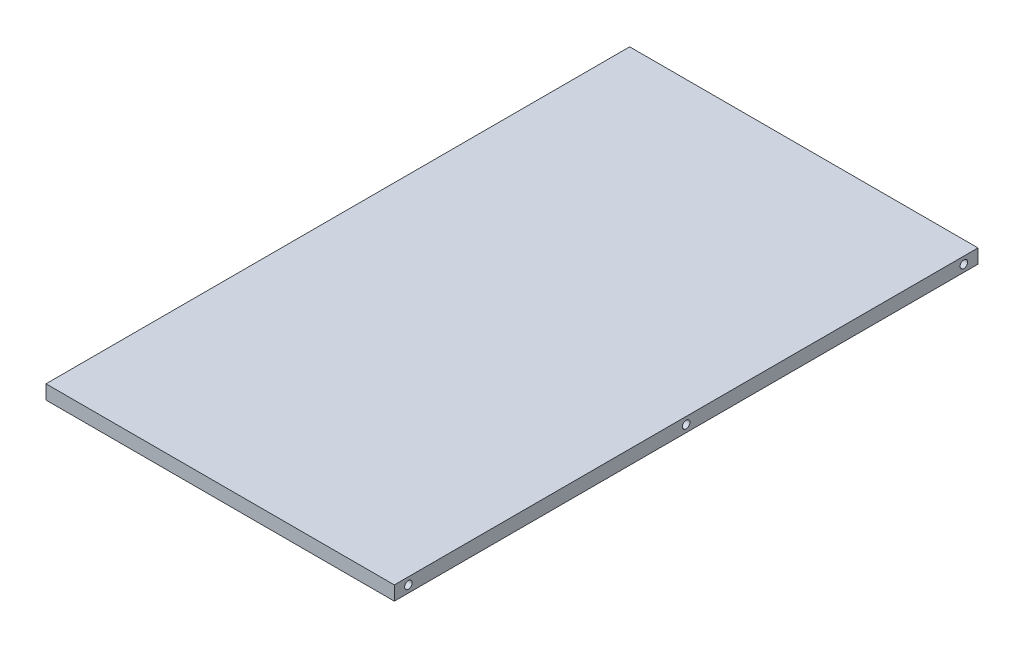
ISO-10303-21;
HEADER;
FILE_DESCRIPTION(('STEP AP214'),'2;1');
FILE_NAME('part.step','',(''),(''),'','','');
FILE_SCHEMA(('AUTOMOTIVE_DESIGN { 1 0 10303 214 1 1 1 1 }'));
ENDSEC;
DATA;
#1=APPLICATION_CONTEXT('core data for automotive mechanical design processes');
#2=APPLICATION_PROTOCOL_DEFINITION('international standard','automotive_design',2000,#1);
#3=PRODUCT_CONTEXT('',#1,'mechanical');
#4=PRODUCT('Part','Part','',(#3));
#5=PRODUCT_RELATED_PRODUCT_CATEGORY('part','',(#4));
#6=PRODUCT_DEFINITION_FORMATION('','',#4);
#7=PRODUCT_DEFINITION_CONTEXT('part definition',#1,'design');
#8=PRODUCT_DEFINITION('design','',#6,#7);
#9=PRODUCT_DEFINITION_SHAPE('','',#8);
#10=(LENGTH_UNIT() NAMED_UNIT(*) SI_UNIT(.MILLI.,.METRE.));
#11=(NAMED_UNIT(*) PLANE_ANGLE_UNIT() SI_UNIT($,.RADIAN.));
#12=(NAMED_UNIT(*) SI_UNIT($,.STERADIAN.) SOLID_ANGLE_UNIT());
#13=UNCERTAINTY_MEASURE_WITH_UNIT(LENGTH_MEASURE(1.E-05),#10,'distance_accuracy_value','');
#14=(GEOMETRIC_REPRESENTATION_CONTEXT(3) GLOBAL_UNCERTAINTY_ASSIGNED_CONTEXT((#13)) GLOBAL_UNIT_ASSIGNED_CONTEXT((#10,
#11,#12)) REPRESENTATION_CONTEXT('',''));
#15=CARTESIAN_POINT('',(0.,0.,0.));
#16=DIRECTION('',(0.,0.,1.));
#17=DIRECTION('',(1.,0.,0.));
#18=AXIS2_PLACEMENT_3D('',#15,#16,#17);
#19=CARTESIAN_POINT('',(185.,15.,310.));
#20=DIRECTION('',(-1.,0.,0.));
#21=DIRECTION('',(0.,0.,1.));
#22=AXIS2_PLACEMENT_3D('',#19,#20,#21);
#23=PLANE('',#22);
#24=CARTESIAN_POINT('',(185.,7.5,0.));
#25=DIRECTION('',(-1.,0.,0.));
#26=DIRECTION('',(0.,0.,1.));
#27=AXIS2_PLACEMENT_3D('',#24,#25,#26);
#28=CIRCLE('',#27,3.99999999999999);
#29=CARTESIAN_POINT('',(185.,7.5,3.99999999999999));
#30=VERTEX_POINT('',#29);
#31=EDGE_CURVE('E170',#30,#30,#28,.T.);
#32=ORIENTED_EDGE('',*,*,#31,.T.);
#33=EDGE_LOOP('',(#32));
#34=FACE_BOUND('',#33,.T.);
#35=CARTESIAN_POINT('',(185.,7.5,295.));
#36=DIRECTION('',(-1.,0.,0.));
#37=DIRECTION('',(0.,0.,1.));
#38=AXIS2_PLACEMENT_3D('',#35,#36,#37);
#39=CIRCLE('',#38,3.99999999999999);
#40=CARTESIAN_POINT('',(185.,7.5,299.));
#41=VERTEX_POINT('',#40);
#42=EDGE_CURVE('E163',#41,#41,#39,.T.);
#43=ORIENTED_EDGE('',*,*,#42,.T.);
#44=EDGE_LOOP('',(#43));
#45=FACE_BOUND('',#44,.T.);
#46=CARTESIAN_POINT('',(185.,7.5,-295.));
#47=DIRECTION('',(-1.,0.,0.));
#48=DIRECTION('',(0.,0.,1.));
#49=AXIS2_PLACEMENT_3D('',#46,#47,#48);
#50=CIRCLE('',#49,3.99999999999999);
#51=CARTESIAN_POINT('',(185.,7.5,-291.));
#52=VERTEX_POINT('',#51);
#53=EDGE_CURVE('E157',#52,#52,#50,.T.);
#54=ORIENTED_EDGE('',*,*,#53,.T.);
#55=EDGE_LOOP('',(#54));
#56=FACE_BOUND('',#55,.T.);
#57=DIRECTION('',(0.,0.,-1.));
#58=VECTOR('',#57,1.);
#59=CARTESIAN_POINT('',(185.,0.,310.));
#60=LINE('',#59,#58);
#61=CARTESIAN_POINT('',(185.,0.,310.));
#62=VERTEX_POINT('',#61);
#63=CARTESIAN_POINT('',(185.,0.,-310.));
#64=VERTEX_POINT('',#63);
#65=EDGE_CURVE('E101',#62,#64,#60,.T.);
#66=ORIENTED_EDGE('',*,*,#65,.T.);
#67=DIRECTION('',(0.,-1.,0.));
#68=VECTOR('',#67,1.);
#69=CARTESIAN_POINT('',(185.,15.,-310.));
#70=LINE('',#69,#68);
#71=CARTESIAN_POINT('',(185.,15.,-310.));
#72=VERTEX_POINT('',#71);
#73=EDGE_CURVE('E11',#72,#64,#70,.T.);
#74=ORIENTED_EDGE('',*,*,#73,.F.);
#75=DIRECTION('',(0.,0.,-1.));
#76=VECTOR('',#75,1.);
#77=CARTESIAN_POINT('',(185.,15.,310.));
#78=LINE('',#77,#76);
#79=CARTESIAN_POINT('',(185.,15.,310.));
#80=VERTEX_POINT('',#79);
#81=EDGE_CURVE('E89',#80,#72,#78,.T.);
#82=ORIENTED_EDGE('',*,*,#81,.F.);
#83=DIRECTION('',(0.,-1.,0.));
#84=VECTOR('',#83,1.);
#85=CARTESIAN_POINT('',(185.,15.,310.));
#86=LINE('',#85,#84);
#87=EDGE_CURVE('E97',#80,#62,#86,.T.);
#88=ORIENTED_EDGE('',*,*,#87,.T.);
#89=EDGE_LOOP('',(#66,#74,#82,#88));
#90=FACE_BOUND('',#89,.T.);
#91=ADVANCED_FACE('F38',(#34,#45,#56,#90),#23,.F.);
#92=CARTESIAN_POINT('',(-185.,15.,-310.));
#93=DIRECTION('',(0.,0.,1.));
#94=DIRECTION('',(1.,0.,0.));
#95=AXIS2_PLACEMENT_3D('',#92,#93,#94);
#96=PLANE('',#95);
#97=CARTESIAN_POINT('',(-170.,7.5,-310.));
#98=DIRECTION('',(0.,0.,-1.));
#99=DIRECTION('',(-1.,0.,0.));
#100=AXIS2_PLACEMENT_3D('',#97,#98,#99);
#101=CIRCLE('',#100,3.99999999999999);
#102=CARTESIAN_POINT('',(-174.,7.5,-310.));
#103=VERTEX_POINT('',#102);
#104=EDGE_CURVE('E189',#103,#103,#101,.T.);
#105=ORIENTED_EDGE('',*,*,#104,.F.);
#106=EDGE_LOOP('',(#105));
#107=FACE_BOUND('',#106,.T.);
#108=CARTESIAN_POINT('',(0.,7.5,-310.));
#109=DIRECTION('',(0.,0.,-1.));
#110=DIRECTION('',(-1.,0.,0.));
#111=AXIS2_PLACEMENT_3D('',#108,#109,#110);
#112=CIRCLE('',#111,3.99999999999999);
#113=CARTESIAN_POINT('',(-3.99999999999999,7.5,-310.));
#114=VERTEX_POINT('',#113);
#115=EDGE_CURVE('E183',#114,#114,#112,.T.);
#116=ORIENTED_EDGE('',*,*,#115,.F.);
#117=EDGE_LOOP('',(#116));
#118=FACE_BOUND('',#117,.T.);
#119=CARTESIAN_POINT('',(170.,7.5,-310.));
#120=DIRECTION('',(0.,0.,-1.));
#121=DIRECTION('',(-1.,0.,0.));
#122=AXIS2_PLACEMENT_3D('',#119,#120,#121);
#123=CIRCLE('',#122,3.99999999999999);
#124=CARTESIAN_POINT('',(166.,7.5,-310.));
#125=VERTEX_POINT('',#124);
#126=EDGE_CURVE('E175',#125,#125,#123,.T.);
#127=ORIENTED_EDGE('',*,*,#126,.F.);
#128=EDGE_LOOP('',(#127));
#129=FACE_BOUND('',#128,.T.);
#130=DIRECTION('',(-1.,0.,0.));
#131=VECTOR('',#130,1.);
#132=CARTESIAN_POINT('',(-185.,0.,-310.));
#133=LINE('',#132,#131);
#134=CARTESIAN_POINT('',(-185.,0.,-310.));
#135=VERTEX_POINT('',#134);
#136=EDGE_CURVE('E93',#64,#135,#133,.T.);
#137=ORIENTED_EDGE('',*,*,#136,.T.);
#138=DIRECTION('',(0.,-1.,0.));
#139=VECTOR('',#138,1.);
#140=CARTESIAN_POINT('',(-185.,15.,-310.));
#141=LINE('',#140,#139);
#142=CARTESIAN_POINT('',(-185.,15.,-310.));
#143=VERTEX_POINT('',#142);
#144=EDGE_CURVE('E46',#143,#135,#141,.T.);
#145=ORIENTED_EDGE('',*,*,#144,.F.);
#146=DIRECTION('',(-1.,0.,0.));
#147=VECTOR('',#146,1.);
#148=CARTESIAN_POINT('',(-185.,15.,-310.));
#149=LINE('',#148,#147);
#150=EDGE_CURVE('E84',#72,#143,#149,.T.);
#151=ORIENTED_EDGE('',*,*,#150,.F.);
#152=ORIENTED_EDGE('',*,*,#73,.T.);
#153=EDGE_LOOP('',(#137,#145,#151,#152));
#154=FACE_BOUND('',#153,.T.);
#155=ADVANCED_FACE('F92',(#107,#118,#129,#154),#96,.F.);
#156=CARTESIAN_POINT('',(-185.,15.,310.));
#157=DIRECTION('',(1.,0.,0.));
#158=DIRECTION('',(0.,0.,-1.));
#159=AXIS2_PLACEMENT_3D('',#156,#157,#158);
#160=PLANE('',#159);
#161=CARTESIAN_POINT('',(-185.,7.5,295.));
#162=DIRECTION('',(-1.,0.,0.));
#163=DIRECTION('',(0.,0.,1.));
#164=AXIS2_PLACEMENT_3D('',#161,#162,#163);
#165=CIRCLE('',#164,3.99999999999999);
#166=CARTESIAN_POINT('',(-185.,7.5,299.));
#167=VERTEX_POINT('',#166);
#168=EDGE_CURVE('E153',#167,#167,#165,.T.);
#169=ORIENTED_EDGE('',*,*,#168,.F.);
#170=EDGE_LOOP('',(#169));
#171=FACE_BOUND('',#170,.T.);
#172=CARTESIAN_POINT('',(-185.,7.5,0.));
#173=DIRECTION('',(-1.,0.,0.));
#174=DIRECTION('',(0.,0.,1.));
#175=AXIS2_PLACEMENT_3D('',#172,#173,#174);
#176=CIRCLE('',#175,3.99999999999999);
#177=CARTESIAN_POINT('',(-185.,7.5,3.99999999999999));
#178=VERTEX_POINT('',#177);
#179=EDGE_CURVE('E147',#178,#178,#176,.T.);
#180=ORIENTED_EDGE('',*,*,#179,.F.);
#181=EDGE_LOOP('',(#180));
#182=FACE_BOUND('',#181,.T.);
#183=CARTESIAN_POINT('',(-185.,7.5,-295.));
#184=DIRECTION('',(-1.,0.,0.));
#185=DIRECTION('',(0.,0.,1.));
#186=AXIS2_PLACEMENT_3D('',#183,#184,#185);
#187=CIRCLE('',#186,3.99999999999999);
#188=CARTESIAN_POINT('',(-185.,7.5,-291.));
#189=VERTEX_POINT('',#188);
#190=EDGE_CURVE('E139',#189,#189,#187,.T.);
#191=ORIENTED_EDGE('',*,*,#190,.F.);
#192=EDGE_LOOP('',(#191));
#193=FACE_BOUND('',#192,.T.);
#194=DIRECTION('',(0.,0.,1.));
#195=VECTOR('',#194,1.);
#196=CARTESIAN_POINT('',(-185.,0.,310.));
#197=LINE('',#196,#195);
#198=CARTESIAN_POINT('',(-185.,0.,310.));
#199=VERTEX_POINT('',#198);
#200=EDGE_CURVE('E71',#135,#199,#197,.T.);
#201=ORIENTED_EDGE('',*,*,#200,.T.);
#202=DIRECTION('',(0.,-1.,0.));
#203=VECTOR('',#202,1.);
#204=CARTESIAN_POINT('',(-185.,15.,310.));
#205=LINE('',#204,#203);
#206=CARTESIAN_POINT('',(-185.,15.,310.));
#207=VERTEX_POINT('',#206);
#208=EDGE_CURVE('E94',#207,#199,#205,.T.);
#209=ORIENTED_EDGE('',*,*,#208,.F.);
#210=DIRECTION('',(0.,0.,1.));
#211=VECTOR('',#210,1.);
#212=CARTESIAN_POINT('',(-185.,15.,310.));
#213=LINE('',#212,#211);
#214=EDGE_CURVE('E87',#143,#207,#213,.T.);
#215=ORIENTED_EDGE('',*,*,#214,.F.);
#216=ORIENTED_EDGE('',*,*,#144,.T.);
#217=EDGE_LOOP('',(#201,#209,#215,#216));
#218=FACE_BOUND('',#217,.T.);
#219=ADVANCED_FACE('F95',(#171,#182,#193,#218),#160,.F.);
#220=CARTESIAN_POINT('',(-185.,15.,310.));
#221=DIRECTION('',(0.,0.,-1.));
#222=DIRECTION('',(-1.,0.,0.));
#223=AXIS2_PLACEMENT_3D('',#220,#221,#222);
#224=PLANE('',#223);
#225=DIRECTION('',(1.,0.,0.));
#226=VECTOR('',#225,1.);
#227=CARTESIAN_POINT('',(-185.,0.,310.));
#228=LINE('',#227,#226);
#229=EDGE_CURVE('E77',#199,#62,#228,.T.);
#230=ORIENTED_EDGE('',*,*,#229,.T.);
#231=ORIENTED_EDGE('',*,*,#87,.F.);
#232=DIRECTION('',(1.,0.,0.));
#233=VECTOR('',#232,1.);
#234=CARTESIAN_POINT('',(-185.,15.,310.));
#235=LINE('',#234,#233);
#236=EDGE_CURVE('E54',#207,#80,#235,.T.);
#237=ORIENTED_EDGE('',*,*,#236,.F.);
#238=ORIENTED_EDGE('',*,*,#208,.T.);
#239=EDGE_LOOP('',(#230,#231,#237,#238));
#240=FACE_BOUND('',#239,.T.);
#241=ADVANCED_FACE('F109',(#240),#224,.F.);
#242=CARTESIAN_POINT('',(0.,15.,0.));
#243=DIRECTION('',(0.,-1.,0.));
#244=DIRECTION('',(0.,0.,-1.));
#245=AXIS2_PLACEMENT_3D('',#242,#243,#244);
#246=PLANE('',#245);
#247=ORIENTED_EDGE('',*,*,#81,.T.);
#248=ORIENTED_EDGE('',*,*,#150,.T.);
#249=ORIENTED_EDGE('',*,*,#214,.T.);
#250=ORIENTED_EDGE('',*,*,#236,.T.);
#251=EDGE_LOOP('',(#247,#248,#249,#250));
#252=FACE_BOUND('',#251,.T.);
#253=ADVANCED_FACE('F85',(#252),#246,.F.);
#254=CARTESIAN_POINT('',(0.,0.,0.));
#255=DIRECTION('',(0.,-1.,0.));
#256=DIRECTION('',(0.,0.,-1.));
#257=AXIS2_PLACEMENT_3D('',#254,#255,#256);
#258=PLANE('',#257);
#259=CARTESIAN_POINT('',(160.,0.,-285.));
#260=DIRECTION('',(0.,-1.,0.));
#261=DIRECTION('',(0.,0.,1.));
#262=AXIS2_PLACEMENT_3D('',#259,#260,#261);
#263=CIRCLE('',#262,2.5);
#264=CARTESIAN_POINT('',(160.,0.,-282.5));
#265=VERTEX_POINT('',#264);
#266=EDGE_CURVE('E124',#265,#265,#263,.T.);
#267=ORIENTED_EDGE('',*,*,#266,.F.);
#268=EDGE_LOOP('',(#267));
#269=FACE_BOUND('',#268,.T.);
#270=CARTESIAN_POINT('',(-160.,0.,-285.));
#271=DIRECTION('',(0.,-1.,0.));
#272=DIRECTION('',(0.,0.,-1.));
#273=AXIS2_PLACEMENT_3D('',#270,#271,#272);
#274=CIRCLE('',#273,2.5);
#275=CARTESIAN_POINT('',(-160.,0.,-287.5));
#276=VERTEX_POINT('',#275);
#277=EDGE_CURVE('E131',#276,#276,#274,.T.);
#278=ORIENTED_EDGE('',*,*,#277,.F.);
#279=EDGE_LOOP('',(#278));
#280=FACE_BOUND('',#279,.T.);
#281=CARTESIAN_POINT('',(-160.,0.,285.));
#282=DIRECTION('',(0.,-1.,0.));
#283=DIRECTION('',(0.,0.,1.));
#284=AXIS2_PLACEMENT_3D('',#281,#282,#283);
#285=CIRCLE('',#284,2.5);
#286=CARTESIAN_POINT('',(-160.,0.,287.5));
#287=VERTEX_POINT('',#286);
#288=EDGE_CURVE('E118',#287,#287,#285,.T.);
#289=ORIENTED_EDGE('',*,*,#288,.F.);
#290=EDGE_LOOP('',(#289));
#291=FACE_BOUND('',#290,.T.);
#292=CARTESIAN_POINT('',(160.,0.,285.));
#293=DIRECTION('',(0.,-1.,0.));
#294=DIRECTION('',(0.,0.,-1.));
#295=AXIS2_PLACEMENT_3D('',#292,#293,#294);
#296=CIRCLE('',#295,2.5);
#297=CARTESIAN_POINT('',(160.,0.,282.5));
#298=VERTEX_POINT('',#297);
#299=EDGE_CURVE('E115',#298,#298,#296,.T.);
#300=ORIENTED_EDGE('',*,*,#299,.F.);
#301=EDGE_LOOP('',(#300));
#302=FACE_BOUND('',#301,.T.);
#303=ORIENTED_EDGE('',*,*,#65,.F.);
#304=ORIENTED_EDGE('',*,*,#229,.F.);
#305=ORIENTED_EDGE('',*,*,#200,.F.);
#306=ORIENTED_EDGE('',*,*,#136,.F.);
#307=EDGE_LOOP('',(#303,#304,#305,#306));
#308=FACE_BOUND('',#307,.T.);
#309=ADVANCED_FACE('F112',(#269,#280,#291,#302,#308),#258,.T.);
#310=CARTESIAN_POINT('',(160.,2.,285.));
#311=DIRECTION('',(0.,-1.,0.));
#312=DIRECTION('',(0.,0.,-1.));
#313=AXIS2_PLACEMENT_3D('',#310,#311,#312);
#314=CYLINDRICAL_SURFACE('',#313,2.5);
#315=CARTESIAN_POINT('',(160.,2.,285.));
#316=DIRECTION('',(0.,-1.,0.));
#317=DIRECTION('',(0.,0.,-1.));
#318=AXIS2_PLACEMENT_3D('',#315,#316,#317);
#319=CIRCLE('',#318,2.5);
#320=CARTESIAN_POINT('',(160.,2.,282.5));
#321=VERTEX_POINT('',#320);
#322=EDGE_CURVE('E104',#321,#321,#319,.T.);
#323=ORIENTED_EDGE('',*,*,#322,.F.);
#324=EDGE_LOOP('',(#323));
#325=FACE_BOUND('',#324,.T.);
#326=ORIENTED_EDGE('',*,*,#299,.T.);
#327=EDGE_LOOP('',(#326));
#328=FACE_BOUND('',#327,.T.);
#329=ADVANCED_FACE('F292',(#325,#328),#314,.F.);
#330=CARTESIAN_POINT('',(160.,2.,285.));
#331=DIRECTION('',(0.,-1.,0.));
#332=DIRECTION('',(0.,0.,-1.));
#333=AXIS2_PLACEMENT_3D('',#330,#331,#332);
#334=PLANE('',#333);
#335=ORIENTED_EDGE('',*,*,#322,.T.);
#336=EDGE_LOOP('',(#335));
#337=FACE_BOUND('',#336,.T.);
#338=ADVANCED_FACE('F270',(#337),#334,.T.);
#339=CARTESIAN_POINT('',(-160.,2.,285.));
#340=DIRECTION('',(0.,-1.,0.));
#341=DIRECTION('',(0.,0.,-1.));
#342=AXIS2_PLACEMENT_3D('',#339,#340,#341);
#343=CYLINDRICAL_SURFACE('',#342,2.5);
#344=CARTESIAN_POINT('',(-160.,2.,285.));
#345=DIRECTION('',(0.,-1.,0.));
#346=DIRECTION('',(0.,0.,1.));
#347=AXIS2_PLACEMENT_3D('',#344,#345,#346);
#348=CIRCLE('',#347,2.5);
#349=CARTESIAN_POINT('',(-160.,2.,287.5));
#350=VERTEX_POINT('',#349);
#351=EDGE_CURVE('E134',#350,#350,#348,.T.);
#352=ORIENTED_EDGE('',*,*,#351,.F.);
#353=EDGE_LOOP('',(#352));
#354=FACE_BOUND('',#353,.T.);
#355=ORIENTED_EDGE('',*,*,#288,.T.);
#356=EDGE_LOOP('',(#355));
#357=FACE_BOUND('',#356,.T.);
#358=ADVANCED_FACE('F266',(#354,#357),#343,.F.);
#359=CARTESIAN_POINT('',(-160.,2.,285.));
#360=DIRECTION('',(0.,1.,0.));
#361=DIRECTION('',(0.,0.,1.));
#362=AXIS2_PLACEMENT_3D('',#359,#360,#361);
#363=PLANE('',#362);
#364=ORIENTED_EDGE('',*,*,#351,.T.);
#365=EDGE_LOOP('',(#364));
#366=FACE_BOUND('',#365,.T.);
#367=ADVANCED_FACE('F269',(#366),#363,.F.);
#368=CARTESIAN_POINT('',(-160.,2.,-285.));
#369=DIRECTION('',(0.,-1.,0.));
#370=DIRECTION('',(0.,0.,-1.));
#371=AXIS2_PLACEMENT_3D('',#368,#369,#370);
#372=CYLINDRICAL_SURFACE('',#371,2.5);
#373=CARTESIAN_POINT('',(-160.,2.,-285.));
#374=DIRECTION('',(0.,-1.,0.));
#375=DIRECTION('',(0.,0.,-1.));
#376=AXIS2_PLACEMENT_3D('',#373,#374,#375);
#377=CIRCLE('',#376,2.5);
#378=CARTESIAN_POINT('',(-160.,2.,-287.5));
#379=VERTEX_POINT('',#378);
#380=EDGE_CURVE('E128',#379,#379,#377,.T.);
#381=ORIENTED_EDGE('',*,*,#380,.F.);
#382=EDGE_LOOP('',(#381));
#383=FACE_BOUND('',#382,.T.);
#384=ORIENTED_EDGE('',*,*,#277,.T.);
#385=EDGE_LOOP('',(#384));
#386=FACE_BOUND('',#385,.T.);
#387=ADVANCED_FACE('F274',(#383,#386),#372,.F.);
#388=CARTESIAN_POINT('',(-160.,2.,-285.));
#389=DIRECTION('',(0.,-1.,0.));
#390=DIRECTION('',(0.,0.,-1.));
#391=AXIS2_PLACEMENT_3D('',#388,#389,#390);
#392=PLANE('',#391);
#393=ORIENTED_EDGE('',*,*,#380,.T.);
#394=EDGE_LOOP('',(#393));
#395=FACE_BOUND('',#394,.T.);
#396=ADVANCED_FACE('F278',(#395),#392,.T.);
#397=CARTESIAN_POINT('',(160.,2.,-285.));
#398=DIRECTION('',(0.,-1.,0.));
#399=DIRECTION('',(0.,0.,-1.));
#400=AXIS2_PLACEMENT_3D('',#397,#398,#399);
#401=CYLINDRICAL_SURFACE('',#400,2.5);
#402=CARTESIAN_POINT('',(160.,2.,-285.));
#403=DIRECTION('',(0.,-1.,0.));
#404=DIRECTION('',(0.,0.,1.));
#405=AXIS2_PLACEMENT_3D('',#402,#403,#404);
#406=CIRCLE('',#405,2.5);
#407=CARTESIAN_POINT('',(160.,2.,-282.5));
#408=VERTEX_POINT('',#407);
#409=EDGE_CURVE('E121',#408,#408,#406,.T.);
#410=ORIENTED_EDGE('',*,*,#409,.F.);
#411=EDGE_LOOP('',(#410));
#412=FACE_BOUND('',#411,.T.);
#413=ORIENTED_EDGE('',*,*,#266,.T.);
#414=EDGE_LOOP('',(#413));
#415=FACE_BOUND('',#414,.T.);
#416=ADVANCED_FACE('F282',(#412,#415),#401,.F.);
#417=CARTESIAN_POINT('',(160.,2.,-285.));
#418=DIRECTION('',(0.,1.,0.));
#419=DIRECTION('',(0.,0.,1.));
#420=AXIS2_PLACEMENT_3D('',#417,#418,#419);
#421=PLANE('',#420);
#422=ORIENTED_EDGE('',*,*,#409,.T.);
#423=EDGE_LOOP('',(#422));
#424=FACE_BOUND('',#423,.T.);
#425=ADVANCED_FACE('F264',(#424),#421,.F.);
#426=CARTESIAN_POINT('',(-175.,7.5,-295.));
#427=DIRECTION('',(-1.,0.,0.));
#428=DIRECTION('',(0.,0.,1.));
#429=AXIS2_PLACEMENT_3D('',#426,#427,#428);
#430=CYLINDRICAL_SURFACE('',#429,3.99999999999999);
#431=CARTESIAN_POINT('',(-175.,7.5,-295.));
#432=DIRECTION('',(-1.,0.,0.));
#433=DIRECTION('',(0.,0.,1.));
#434=AXIS2_PLACEMENT_3D('',#431,#432,#433);
#435=CIRCLE('',#434,3.99999999999999);
#436=CARTESIAN_POINT('',(-175.,7.5,-291.));
#437=VERTEX_POINT('',#436);
#438=EDGE_CURVE('E125',#437,#437,#435,.T.);
#439=ORIENTED_EDGE('',*,*,#438,.F.);
#440=EDGE_LOOP('',(#439));
#441=FACE_BOUND('',#440,.T.);
#442=ORIENTED_EDGE('',*,*,#190,.T.);
#443=EDGE_LOOP('',(#442));
#444=FACE_BOUND('',#443,.T.);
#445=ADVANCED_FACE('F260',(#441,#444),#430,.F.);
#446=CARTESIAN_POINT('',(-175.,7.5,-295.));
#447=DIRECTION('',(-1.,0.,0.));
#448=DIRECTION('',(0.,0.,1.));
#449=AXIS2_PLACEMENT_3D('',#446,#447,#448);
#450=PLANE('',#449);
#451=ORIENTED_EDGE('',*,*,#438,.T.);
#452=EDGE_LOOP('',(#451));
#453=FACE_BOUND('',#452,.T.);
#454=ADVANCED_FACE('F256',(#453),#450,.T.);
#455=CARTESIAN_POINT('',(-175.,7.5,0.));
#456=DIRECTION('',(-1.,0.,0.));
#457=DIRECTION('',(0.,0.,1.));
#458=AXIS2_PLACEMENT_3D('',#455,#456,#457);
#459=CYLINDRICAL_SURFACE('',#458,3.99999999999999);
#460=CARTESIAN_POINT('',(-175.,7.5,0.));
#461=DIRECTION('',(-1.,0.,0.));
#462=DIRECTION('',(0.,0.,1.));
#463=AXIS2_PLACEMENT_3D('',#460,#461,#462);
#464=CIRCLE('',#463,3.99999999999999);
#465=CARTESIAN_POINT('',(-175.,7.5,3.99999999999999));
#466=VERTEX_POINT('',#465);
#467=EDGE_CURVE('E142',#466,#466,#464,.T.);
#468=ORIENTED_EDGE('',*,*,#467,.F.);
#469=EDGE_LOOP('',(#468));
#470=FACE_BOUND('',#469,.T.);
#471=ORIENTED_EDGE('',*,*,#179,.T.);
#472=EDGE_LOOP('',(#471));
#473=FACE_BOUND('',#472,.T.);
#474=ADVANCED_FACE('F252',(#470,#473),#459,.F.);
#475=CARTESIAN_POINT('',(-175.,7.5,0.));
#476=DIRECTION('',(-1.,0.,0.));
#477=DIRECTION('',(0.,0.,1.));
#478=AXIS2_PLACEMENT_3D('',#475,#476,#477);
#479=PLANE('',#478);
#480=ORIENTED_EDGE('',*,*,#467,.T.);
#481=EDGE_LOOP('',(#480));
#482=FACE_BOUND('',#481,.T.);
#483=ADVANCED_FACE('F248',(#482),#479,.T.);
#484=CARTESIAN_POINT('',(-175.,7.5,295.));
#485=DIRECTION('',(-1.,0.,0.));
#486=DIRECTION('',(0.,0.,1.));
#487=AXIS2_PLACEMENT_3D('',#484,#485,#486);
#488=CYLINDRICAL_SURFACE('',#487,3.99999999999999);
#489=CARTESIAN_POINT('',(-175.,7.5,295.));
#490=DIRECTION('',(-1.,0.,0.));
#491=DIRECTION('',(0.,0.,1.));
#492=AXIS2_PLACEMENT_3D('',#489,#490,#491);
#493=CIRCLE('',#492,3.99999999999999);
#494=CARTESIAN_POINT('',(-175.,7.5,299.));
#495=VERTEX_POINT('',#494);
#496=EDGE_CURVE('E150',#495,#495,#493,.T.);
#497=ORIENTED_EDGE('',*,*,#496,.F.);
#498=EDGE_LOOP('',(#497));
#499=FACE_BOUND('',#498,.T.);
#500=ORIENTED_EDGE('',*,*,#168,.T.);
#501=EDGE_LOOP('',(#500));
#502=FACE_BOUND('',#501,.T.);
#503=ADVANCED_FACE('F241',(#499,#502),#488,.F.);
#504=CARTESIAN_POINT('',(-175.,7.5,295.));
#505=DIRECTION('',(-1.,0.,0.));
#506=DIRECTION('',(0.,0.,1.));
#507=AXIS2_PLACEMENT_3D('',#504,#505,#506);
#508=PLANE('',#507);
#509=ORIENTED_EDGE('',*,*,#496,.T.);
#510=EDGE_LOOP('',(#509));
#511=FACE_BOUND('',#510,.T.);
#512=ADVANCED_FACE('F231',(#511),#508,.T.);
#513=CARTESIAN_POINT('',(175.,7.5,-295.));
#514=DIRECTION('',(1.,0.,0.));
#515=DIRECTION('',(0.,0.,-1.));
#516=AXIS2_PLACEMENT_3D('',#513,#514,#515);
#517=CYLINDRICAL_SURFACE('',#516,3.99999999999999);
#518=CARTESIAN_POINT('',(175.,7.5,-295.));
#519=DIRECTION('',(-1.,0.,0.));
#520=DIRECTION('',(0.,0.,1.));
#521=AXIS2_PLACEMENT_3D('',#518,#519,#520);
#522=CIRCLE('',#521,3.99999999999999);
#523=CARTESIAN_POINT('',(175.,7.5,-291.));
#524=VERTEX_POINT('',#523);
#525=EDGE_CURVE('E156',#524,#524,#522,.T.);
#526=ORIENTED_EDGE('',*,*,#525,.T.);
#527=EDGE_LOOP('',(#526));
#528=FACE_BOUND('',#527,.T.);
#529=ORIENTED_EDGE('',*,*,#53,.F.);
#530=EDGE_LOOP('',(#529));
#531=FACE_BOUND('',#530,.T.);
#532=ADVANCED_FACE('F228',(#528,#531),#517,.F.);
#533=CARTESIAN_POINT('',(175.,7.5,-295.));
#534=DIRECTION('',(1.,0.,0.));
#535=DIRECTION('',(0.,0.,1.));
#536=AXIS2_PLACEMENT_3D('',#533,#534,#535);
#537=PLANE('',#536);
#538=ORIENTED_EDGE('',*,*,#525,.F.);
#539=EDGE_LOOP('',(#538));
#540=FACE_BOUND('',#539,.T.);
#541=ADVANCED_FACE('F230',(#540),#537,.T.);
#542=CARTESIAN_POINT('',(175.,7.5,295.));
#543=DIRECTION('',(1.,0.,0.));
#544=DIRECTION('',(0.,0.,-1.));
#545=AXIS2_PLACEMENT_3D('',#542,#543,#544);
#546=CYLINDRICAL_SURFACE('',#545,3.99999999999999);
#547=CARTESIAN_POINT('',(175.,7.5,295.));
#548=DIRECTION('',(-1.,0.,0.));
#549=DIRECTION('',(0.,0.,1.));
#550=AXIS2_PLACEMENT_3D('',#547,#548,#549);
#551=CIRCLE('',#550,3.99999999999999);
#552=CARTESIAN_POINT('',(175.,7.5,299.));
#553=VERTEX_POINT('',#552);
#554=EDGE_CURVE('E166',#553,#553,#551,.T.);
#555=ORIENTED_EDGE('',*,*,#554,.T.);
#556=EDGE_LOOP('',(#555));
#557=FACE_BOUND('',#556,.T.);
#558=ORIENTED_EDGE('',*,*,#42,.F.);
#559=EDGE_LOOP('',(#558));
#560=FACE_BOUND('',#559,.T.);
#561=ADVANCED_FACE('F238',(#557,#560),#546,.F.);
#562=CARTESIAN_POINT('',(175.,7.5,295.));
#563=DIRECTION('',(1.,0.,0.));
#564=DIRECTION('',(0.,0.,1.));
#565=AXIS2_PLACEMENT_3D('',#562,#563,#564);
#566=PLANE('',#565);
#567=ORIENTED_EDGE('',*,*,#554,.F.);
#568=EDGE_LOOP('',(#567));
#569=FACE_BOUND('',#568,.T.);
#570=ADVANCED_FACE('F414',(#569),#566,.T.);
#571=CARTESIAN_POINT('',(175.,7.5,0.));
#572=DIRECTION('',(1.,0.,0.));
#573=DIRECTION('',(0.,0.,-1.));
#574=AXIS2_PLACEMENT_3D('',#571,#572,#573);
#575=CYLINDRICAL_SURFACE('',#574,3.99999999999999);
#576=CARTESIAN_POINT('',(175.,7.5,0.));
#577=DIRECTION('',(-1.,0.,0.));
#578=DIRECTION('',(0.,0.,1.));
#579=AXIS2_PLACEMENT_3D('',#576,#577,#578);
#580=CIRCLE('',#579,3.99999999999999);
#581=CARTESIAN_POINT('',(175.,7.5,3.99999999999999));
#582=VERTEX_POINT('',#581);
#583=EDGE_CURVE('E160',#582,#582,#580,.T.);
#584=ORIENTED_EDGE('',*,*,#583,.T.);
#585=EDGE_LOOP('',(#584));
#586=FACE_BOUND('',#585,.T.);
#587=ORIENTED_EDGE('',*,*,#31,.F.);
#588=EDGE_LOOP('',(#587));
#589=FACE_BOUND('',#588,.T.);
#590=ADVANCED_FACE('F214',(#586,#589),#575,.F.);
#591=CARTESIAN_POINT('',(175.,7.5,0.));
#592=DIRECTION('',(1.,0.,0.));
#593=DIRECTION('',(0.,0.,1.));
#594=AXIS2_PLACEMENT_3D('',#591,#592,#593);
#595=PLANE('',#594);
#596=ORIENTED_EDGE('',*,*,#583,.F.);
#597=EDGE_LOOP('',(#596));
#598=FACE_BOUND('',#597,.T.);
#599=ADVANCED_FACE('F204',(#598),#595,.T.);
#600=CARTESIAN_POINT('',(170.,7.5,-300.));
#601=DIRECTION('',(0.,0.,-1.));
#602=DIRECTION('',(-1.,0.,0.));
#603=AXIS2_PLACEMENT_3D('',#600,#601,#602);
#604=CYLINDRICAL_SURFACE('',#603,3.99999999999999);
#605=CARTESIAN_POINT('',(170.,7.5,-300.));
#606=DIRECTION('',(0.,0.,-1.));
#607=DIRECTION('',(-1.,0.,0.));
#608=AXIS2_PLACEMENT_3D('',#605,#606,#607);
#609=CIRCLE('',#608,3.99999999999999);
#610=CARTESIAN_POINT('',(166.,7.5,-300.));
#611=VERTEX_POINT('',#610);
#612=EDGE_CURVE('E167',#611,#611,#609,.T.);
#613=ORIENTED_EDGE('',*,*,#612,.F.);
#614=EDGE_LOOP('',(#613));
#615=FACE_BOUND('',#614,.T.);
#616=ORIENTED_EDGE('',*,*,#126,.T.);
#617=EDGE_LOOP('',(#616));
#618=FACE_BOUND('',#617,.T.);
#619=ADVANCED_FACE('F201',(#615,#618),#604,.F.);
#620=CARTESIAN_POINT('',(170.,7.5,-300.));
#621=DIRECTION('',(0.,0.,-1.));
#622=DIRECTION('',(-1.,0.,0.));
#623=AXIS2_PLACEMENT_3D('',#620,#621,#622);
#624=PLANE('',#623);
#625=ORIENTED_EDGE('',*,*,#612,.T.);
#626=EDGE_LOOP('',(#625));
#627=FACE_BOUND('',#626,.T.);
#628=ADVANCED_FACE('F203',(#627),#624,.T.);
#629=CARTESIAN_POINT('',(0.,7.5,-300.));
#630=DIRECTION('',(0.,0.,-1.));
#631=DIRECTION('',(-1.,0.,0.));
#632=AXIS2_PLACEMENT_3D('',#629,#630,#631);
#633=CYLINDRICAL_SURFACE('',#632,3.99999999999999);
#634=CARTESIAN_POINT('',(0.,7.5,-300.));
#635=DIRECTION('',(0.,0.,-1.));
#636=DIRECTION('',(-1.,0.,0.));
#637=AXIS2_PLACEMENT_3D('',#634,#635,#636);
#638=CIRCLE('',#637,3.99999999999999);
#639=CARTESIAN_POINT('',(-3.99999999999999,7.5,-300.));
#640=VERTEX_POINT('',#639);
#641=EDGE_CURVE('E178',#640,#640,#638,.T.);
#642=ORIENTED_EDGE('',*,*,#641,.F.);
#643=EDGE_LOOP('',(#642));
#644=FACE_BOUND('',#643,.T.);
#645=ORIENTED_EDGE('',*,*,#115,.T.);
#646=EDGE_LOOP('',(#645));
#647=FACE_BOUND('',#646,.T.);
#648=ADVANCED_FACE('F211',(#644,#647),#633,.F.);
#649=CARTESIAN_POINT('',(0.,7.5,-300.));
#650=DIRECTION('',(0.,0.,-1.));
#651=DIRECTION('',(-1.,0.,0.));
#652=AXIS2_PLACEMENT_3D('',#649,#650,#651);
#653=PLANE('',#652);
#654=ORIENTED_EDGE('',*,*,#641,.T.);
#655=EDGE_LOOP('',(#654));
#656=FACE_BOUND('',#655,.T.);
#657=ADVANCED_FACE('F467',(#656),#653,.T.);
#658=CARTESIAN_POINT('',(-170.,7.5,-300.));
#659=DIRECTION('',(0.,0.,-1.));
#660=DIRECTION('',(-1.,0.,0.));
#661=AXIS2_PLACEMENT_3D('',#658,#659,#660);
#662=CYLINDRICAL_SURFACE('',#661,3.99999999999999);
#663=CARTESIAN_POINT('',(-170.,7.5,-300.));
#664=DIRECTION('',(0.,0.,-1.));
#665=DIRECTION('',(-1.,0.,0.));
#666=AXIS2_PLACEMENT_3D('',#663,#664,#665);
#667=CIRCLE('',#666,3.99999999999999);
#668=CARTESIAN_POINT('',(-174.,7.5,-300.));
#669=VERTEX_POINT('',#668);
#670=EDGE_CURVE('E186',#669,#669,#667,.T.);
#671=ORIENTED_EDGE('',*,*,#670,.F.);
#672=EDGE_LOOP('',(#671));
#673=FACE_BOUND('',#672,.T.);
#674=ORIENTED_EDGE('',*,*,#104,.T.);
#675=EDGE_LOOP('',(#674));
#676=FACE_BOUND('',#675,.T.);
#677=ADVANCED_FACE('F193',(#673,#676),#662,.F.);
#678=CARTESIAN_POINT('',(-170.,7.5,-300.));
#679=DIRECTION('',(0.,0.,-1.));
#680=DIRECTION('',(-1.,0.,0.));
#681=AXIS2_PLACEMENT_3D('',#678,#679,#680);
#682=PLANE('',#681);
#683=ORIENTED_EDGE('',*,*,#670,.T.);
#684=EDGE_LOOP('',(#683));
#685=FACE_BOUND('',#684,.T.);
#686=ADVANCED_FACE('F488',(#685),#682,.T.);
#687=CLOSED_SHELL('',(#91,#155,#219,#241,#253,#309,#329,#338,#358,#367,#387,#396,#416,#425,#445,
#454,#474,#483,#503,#512,#532,#541,#561,#570,#590,#599,#619,#628,#648,#657,#677,#686));
#688=MANIFOLD_SOLID_BREP('B2',#687);
#689=ADVANCED_BREP_SHAPE_REPRESENTATION('',(#18,#688),#14);
#690=SHAPE_DEFINITION_REPRESENTATION(#9,#689);
ENDSEC;
END-ISO-10303-21;
